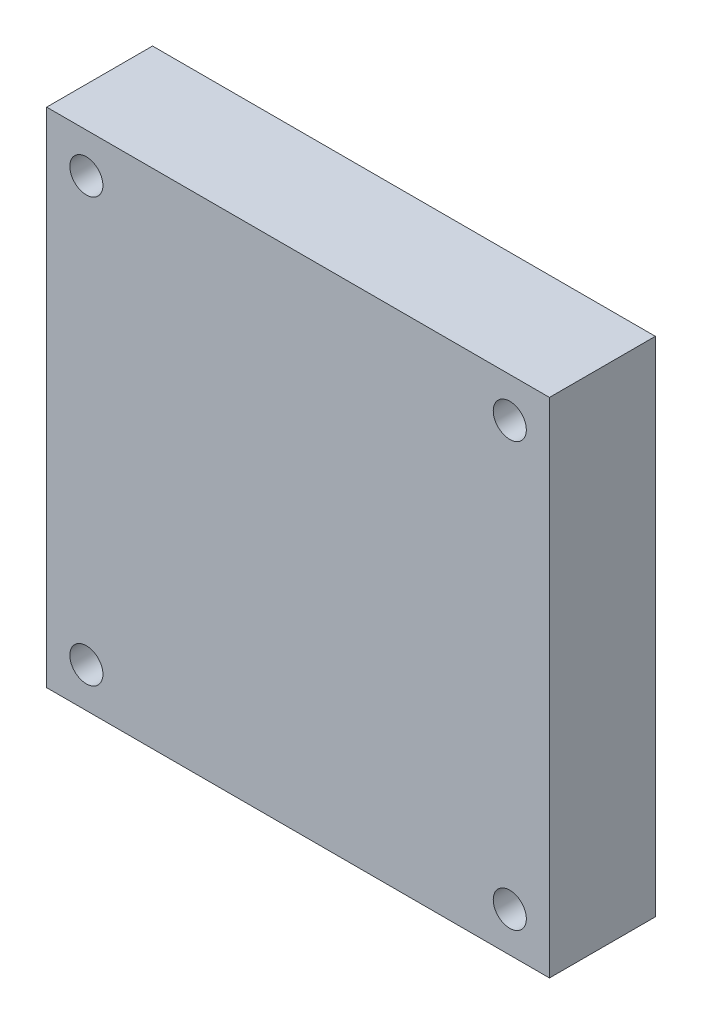
ISO-10303-21;
HEADER;
FILE_DESCRIPTION(('STEP AP214'),'2;1');
FILE_NAME('part.step','',(''),(''),'','','');
FILE_SCHEMA(('AUTOMOTIVE_DESIGN { 1 0 10303 214 1 1 1 1 }'));
ENDSEC;
DATA;
#1=APPLICATION_CONTEXT('core data for automotive mechanical design processes');
#2=APPLICATION_PROTOCOL_DEFINITION('international standard','automotive_design',2000,#1);
#3=PRODUCT_CONTEXT('',#1,'mechanical');
#4=PRODUCT('Part','Part','',(#3));
#5=PRODUCT_RELATED_PRODUCT_CATEGORY('part','',(#4));
#6=PRODUCT_DEFINITION_FORMATION('','',#4);
#7=PRODUCT_DEFINITION_CONTEXT('part definition',#1,'design');
#8=PRODUCT_DEFINITION('design','',#6,#7);
#9=PRODUCT_DEFINITION_SHAPE('','',#8);
#10=(LENGTH_UNIT() NAMED_UNIT(*) SI_UNIT(.MILLI.,.METRE.));
#11=(NAMED_UNIT(*) PLANE_ANGLE_UNIT() SI_UNIT($,.RADIAN.));
#12=(NAMED_UNIT(*) SI_UNIT($,.STERADIAN.) SOLID_ANGLE_UNIT());
#13=UNCERTAINTY_MEASURE_WITH_UNIT(LENGTH_MEASURE(1.E-05),#10,'distance_accuracy_value','');
#14=(GEOMETRIC_REPRESENTATION_CONTEXT(3) GLOBAL_UNCERTAINTY_ASSIGNED_CONTEXT((#13)) GLOBAL_UNIT_ASSIGNED_CONTEXT((#10,
#11,#12)) REPRESENTATION_CONTEXT('',''));
#15=CARTESIAN_POINT('',(0.,0.,0.));
#16=DIRECTION('',(0.,0.,1.));
#17=DIRECTION('',(1.,0.,0.));
#18=AXIS2_PLACEMENT_3D('',#15,#16,#17);
#19=CARTESIAN_POINT('',(0.,0.,4.));
#20=DIRECTION('',(0.,0.,-1.));
#21=DIRECTION('',(-1.,0.,0.));
#22=AXIS2_PLACEMENT_3D('',#19,#20,#21);
#23=PLANE('',#22);
#24=CARTESIAN_POINT('',(-16.,-16.,4.));
#25=DIRECTION('',(0.,0.,-1.));
#26=DIRECTION('',(1.,0.,0.));
#27=AXIS2_PLACEMENT_3D('',#24,#25,#26);
#28=CIRCLE('',#27,1.25);
#29=CARTESIAN_POINT('',(-14.75,-16.,4.));
#30=VERTEX_POINT('',#29);
#31=EDGE_CURVE('E120',#30,#30,#28,.T.);
#32=ORIENTED_EDGE('',*,*,#31,.T.);
#33=EDGE_LOOP('',(#32));
#34=FACE_BOUND('',#33,.T.);
#35=CARTESIAN_POINT('',(-16.,16.,4.));
#36=DIRECTION('',(0.,0.,1.));
#37=DIRECTION('',(1.,0.,0.));
#38=AXIS2_PLACEMENT_3D('',#35,#36,#37);
#39=CIRCLE('',#38,1.25);
#40=CARTESIAN_POINT('',(-14.75,16.,4.));
#41=VERTEX_POINT('',#40);
#42=EDGE_CURVE('E114',#41,#41,#39,.T.);
#43=ORIENTED_EDGE('',*,*,#42,.F.);
#44=EDGE_LOOP('',(#43));
#45=FACE_BOUND('',#44,.T.);
#46=DIRECTION('',(0.,1.,0.));
#47=VECTOR('',#46,1.);
#48=CARTESIAN_POINT('',(19.,-19.,4.));
#49=LINE('',#48,#47);
#50=CARTESIAN_POINT('',(19.,-19.,4.));
#51=VERTEX_POINT('',#50);
#52=CARTESIAN_POINT('',(19.,19.,4.));
#53=VERTEX_POINT('',#52);
#54=EDGE_CURVE('E87',#51,#53,#49,.T.);
#55=ORIENTED_EDGE('',*,*,#54,.T.);
#56=DIRECTION('',(-1.,0.,0.));
#57=VECTOR('',#56,1.);
#58=CARTESIAN_POINT('',(-19.,19.,4.));
#59=LINE('',#58,#57);
#60=CARTESIAN_POINT('',(-19.,19.,4.));
#61=VERTEX_POINT('',#60);
#62=EDGE_CURVE('E82',#53,#61,#59,.T.);
#63=ORIENTED_EDGE('',*,*,#62,.T.);
#64=DIRECTION('',(0.,-1.,0.));
#65=VECTOR('',#64,1.);
#66=CARTESIAN_POINT('',(-19.,-19.,4.));
#67=LINE('',#66,#65);
#68=CARTESIAN_POINT('',(-19.,-19.,4.));
#69=VERTEX_POINT('',#68);
#70=EDGE_CURVE('E85',#61,#69,#67,.T.);
#71=ORIENTED_EDGE('',*,*,#70,.T.);
#72=DIRECTION('',(1.,0.,0.));
#73=VECTOR('',#72,1.);
#74=CARTESIAN_POINT('',(-19.,-19.,4.));
#75=LINE('',#74,#73);
#76=EDGE_CURVE('E52',#69,#51,#75,.T.);
#77=ORIENTED_EDGE('',*,*,#76,.T.);
#78=EDGE_LOOP('',(#55,#63,#71,#77));
#79=FACE_BOUND('',#78,.T.);
#80=CARTESIAN_POINT('',(16.,-16.,4.));
#81=DIRECTION('',(0.,0.,1.));
#82=DIRECTION('',(-1.,0.,0.));
#83=AXIS2_PLACEMENT_3D('',#80,#81,#82);
#84=CIRCLE('',#83,1.25);
#85=CARTESIAN_POINT('',(14.75,-16.,4.));
#86=VERTEX_POINT('',#85);
#87=EDGE_CURVE('E126',#86,#86,#84,.T.);
#88=ORIENTED_EDGE('',*,*,#87,.F.);
#89=EDGE_LOOP('',(#88));
#90=FACE_BOUND('',#89,.T.);
#91=CARTESIAN_POINT('',(16.,16.,4.));
#92=DIRECTION('',(0.,0.,-1.));
#93=DIRECTION('',(-1.,0.,0.));
#94=AXIS2_PLACEMENT_3D('',#91,#92,#93);
#95=CIRCLE('',#94,1.25);
#96=CARTESIAN_POINT('',(14.75,16.,4.));
#97=VERTEX_POINT('',#96);
#98=EDGE_CURVE('E132',#97,#97,#95,.T.);
#99=ORIENTED_EDGE('',*,*,#98,.T.);
#100=EDGE_LOOP('',(#99));
#101=FACE_BOUND('',#100,.T.);
#102=ADVANCED_FACE('F35',(#34,#45,#79,#90,#101),#23,.F.);
#103=CARTESIAN_POINT('',(0.,0.,-4.));
#104=DIRECTION('',(0.,0.,-1.));
#105=DIRECTION('',(-1.,0.,0.));
#106=AXIS2_PLACEMENT_3D('',#103,#104,#105);
#107=PLANE('',#106);
#108=CARTESIAN_POINT('',(-16.,-16.,-4.));
#109=DIRECTION('',(0.,0.,-1.));
#110=DIRECTION('',(1.,0.,0.));
#111=AXIS2_PLACEMENT_3D('',#108,#109,#110);
#112=CIRCLE('',#111,1.25);
#113=CARTESIAN_POINT('',(-14.75,-16.,-4.));
#114=VERTEX_POINT('',#113);
#115=EDGE_CURVE('E117',#114,#114,#112,.T.);
#116=ORIENTED_EDGE('',*,*,#115,.F.);
#117=EDGE_LOOP('',(#116));
#118=FACE_BOUND('',#117,.T.);
#119=CARTESIAN_POINT('',(-16.,16.,-4.));
#120=DIRECTION('',(0.,0.,1.));
#121=DIRECTION('',(1.,0.,0.));
#122=AXIS2_PLACEMENT_3D('',#119,#120,#121);
#123=CIRCLE('',#122,1.25);
#124=CARTESIAN_POINT('',(-14.75,16.,-4.));
#125=VERTEX_POINT('',#124);
#126=EDGE_CURVE('E102',#125,#125,#123,.T.);
#127=ORIENTED_EDGE('',*,*,#126,.T.);
#128=EDGE_LOOP('',(#127));
#129=FACE_BOUND('',#128,.T.);
#130=DIRECTION('',(0.,1.,0.));
#131=VECTOR('',#130,1.);
#132=CARTESIAN_POINT('',(19.,-19.,-4.));
#133=LINE('',#132,#131);
#134=CARTESIAN_POINT('',(19.,-19.,-4.));
#135=VERTEX_POINT('',#134);
#136=CARTESIAN_POINT('',(19.,19.,-4.));
#137=VERTEX_POINT('',#136);
#138=EDGE_CURVE('E99',#135,#137,#133,.T.);
#139=ORIENTED_EDGE('',*,*,#138,.F.);
#140=DIRECTION('',(1.,0.,0.));
#141=VECTOR('',#140,1.);
#142=CARTESIAN_POINT('',(-19.,-19.,-4.));
#143=LINE('',#142,#141);
#144=CARTESIAN_POINT('',(-19.,-19.,-4.));
#145=VERTEX_POINT('',#144);
#146=EDGE_CURVE('E75',#145,#135,#143,.T.);
#147=ORIENTED_EDGE('',*,*,#146,.F.);
#148=DIRECTION('',(0.,-1.,0.));
#149=VECTOR('',#148,1.);
#150=CARTESIAN_POINT('',(-19.,-19.,-4.));
#151=LINE('',#150,#149);
#152=CARTESIAN_POINT('',(-19.,19.,-4.));
#153=VERTEX_POINT('',#152);
#154=EDGE_CURVE('E69',#153,#145,#151,.T.);
#155=ORIENTED_EDGE('',*,*,#154,.F.);
#156=DIRECTION('',(-1.,0.,0.));
#157=VECTOR('',#156,1.);
#158=CARTESIAN_POINT('',(-19.,19.,-4.));
#159=LINE('',#158,#157);
#160=EDGE_CURVE('E91',#137,#153,#159,.T.);
#161=ORIENTED_EDGE('',*,*,#160,.F.);
#162=EDGE_LOOP('',(#139,#147,#155,#161));
#163=FACE_BOUND('',#162,.T.);
#164=CARTESIAN_POINT('',(16.,-16.,-4.));
#165=DIRECTION('',(0.,0.,1.));
#166=DIRECTION('',(-1.,0.,0.));
#167=AXIS2_PLACEMENT_3D('',#164,#165,#166);
#168=CIRCLE('',#167,1.25);
#169=CARTESIAN_POINT('',(14.75,-16.,-4.));
#170=VERTEX_POINT('',#169);
#171=EDGE_CURVE('E123',#170,#170,#168,.T.);
#172=ORIENTED_EDGE('',*,*,#171,.T.);
#173=EDGE_LOOP('',(#172));
#174=FACE_BOUND('',#173,.T.);
#175=CARTESIAN_POINT('',(16.,16.,-4.));
#176=DIRECTION('',(0.,0.,-1.));
#177=DIRECTION('',(-1.,0.,0.));
#178=AXIS2_PLACEMENT_3D('',#175,#176,#177);
#179=CIRCLE('',#178,1.25);
#180=CARTESIAN_POINT('',(14.75,16.,-4.));
#181=VERTEX_POINT('',#180);
#182=EDGE_CURVE('E129',#181,#181,#179,.T.);
#183=ORIENTED_EDGE('',*,*,#182,.F.);
#184=EDGE_LOOP('',(#183));
#185=FACE_BOUND('',#184,.T.);
#186=ADVANCED_FACE('F110',(#118,#129,#163,#174,#185),#107,.T.);
#187=CARTESIAN_POINT('',(19.,-19.,4.));
#188=DIRECTION('',(-1.,0.,0.));
#189=DIRECTION('',(0.,0.,1.));
#190=AXIS2_PLACEMENT_3D('',#187,#188,#189);
#191=PLANE('',#190);
#192=ORIENTED_EDGE('',*,*,#138,.T.);
#193=DIRECTION('',(0.,0.,-1.));
#194=VECTOR('',#193,1.);
#195=CARTESIAN_POINT('',(19.,19.,4.));
#196=LINE('',#195,#194);
#197=EDGE_CURVE('E11',#53,#137,#196,.T.);
#198=ORIENTED_EDGE('',*,*,#197,.F.);
#199=ORIENTED_EDGE('',*,*,#54,.F.);
#200=DIRECTION('',(0.,0.,-1.));
#201=VECTOR('',#200,1.);
#202=CARTESIAN_POINT('',(19.,-19.,4.));
#203=LINE('',#202,#201);
#204=EDGE_CURVE('E95',#51,#135,#203,.T.);
#205=ORIENTED_EDGE('',*,*,#204,.T.);
#206=EDGE_LOOP('',(#192,#198,#199,#205));
#207=FACE_BOUND('',#206,.T.);
#208=ADVANCED_FACE('F37',(#207),#191,.F.);
#209=CARTESIAN_POINT('',(-19.,19.,4.));
#210=DIRECTION('',(0.,-1.,0.));
#211=DIRECTION('',(0.,0.,-1.));
#212=AXIS2_PLACEMENT_3D('',#209,#210,#211);
#213=PLANE('',#212);
#214=ORIENTED_EDGE('',*,*,#160,.T.);
#215=DIRECTION('',(0.,0.,-1.));
#216=VECTOR('',#215,1.);
#217=CARTESIAN_POINT('',(-19.,19.,4.));
#218=LINE('',#217,#216);
#219=EDGE_CURVE('E44',#61,#153,#218,.T.);
#220=ORIENTED_EDGE('',*,*,#219,.F.);
#221=ORIENTED_EDGE('',*,*,#62,.F.);
#222=ORIENTED_EDGE('',*,*,#197,.T.);
#223=EDGE_LOOP('',(#214,#220,#221,#222));
#224=FACE_BOUND('',#223,.T.);
#225=ADVANCED_FACE('F90',(#224),#213,.F.);
#226=CARTESIAN_POINT('',(-19.,-19.,4.));
#227=DIRECTION('',(1.,0.,0.));
#228=DIRECTION('',(0.,0.,-1.));
#229=AXIS2_PLACEMENT_3D('',#226,#227,#228);
#230=PLANE('',#229);
#231=ORIENTED_EDGE('',*,*,#154,.T.);
#232=DIRECTION('',(0.,0.,-1.));
#233=VECTOR('',#232,1.);
#234=CARTESIAN_POINT('',(-19.,-19.,4.));
#235=LINE('',#234,#233);
#236=EDGE_CURVE('E92',#69,#145,#235,.T.);
#237=ORIENTED_EDGE('',*,*,#236,.F.);
#238=ORIENTED_EDGE('',*,*,#70,.F.);
#239=ORIENTED_EDGE('',*,*,#219,.T.);
#240=EDGE_LOOP('',(#231,#237,#238,#239));
#241=FACE_BOUND('',#240,.T.);
#242=ADVANCED_FACE('F93',(#241),#230,.F.);
#243=CARTESIAN_POINT('',(-19.,-19.,4.));
#244=DIRECTION('',(0.,1.,0.));
#245=DIRECTION('',(0.,0.,1.));
#246=AXIS2_PLACEMENT_3D('',#243,#244,#245);
#247=PLANE('',#246);
#248=ORIENTED_EDGE('',*,*,#146,.T.);
#249=ORIENTED_EDGE('',*,*,#204,.F.);
#250=ORIENTED_EDGE('',*,*,#76,.F.);
#251=ORIENTED_EDGE('',*,*,#236,.T.);
#252=EDGE_LOOP('',(#248,#249,#250,#251));
#253=FACE_BOUND('',#252,.T.);
#254=ADVANCED_FACE('F107',(#253),#247,.F.);
#255=CARTESIAN_POINT('',(-16.,16.,-4.));
#256=DIRECTION('',(0.,0.,1.));
#257=DIRECTION('',(1.,0.,0.));
#258=AXIS2_PLACEMENT_3D('',#255,#256,#257);
#259=CYLINDRICAL_SURFACE('',#258,1.25);
#260=ORIENTED_EDGE('',*,*,#126,.F.);
#261=EDGE_LOOP('',(#260));
#262=FACE_BOUND('',#261,.T.);
#263=ORIENTED_EDGE('',*,*,#42,.T.);
#264=EDGE_LOOP('',(#263));
#265=FACE_BOUND('',#264,.T.);
#266=ADVANCED_FACE('F156',(#262,#265),#259,.F.);
#267=CARTESIAN_POINT('',(-16.,-16.,-4.));
#268=DIRECTION('',(0.,0.,1.));
#269=DIRECTION('',(1.,0.,0.));
#270=AXIS2_PLACEMENT_3D('',#267,#268,#269);
#271=CYLINDRICAL_SURFACE('',#270,1.25);
#272=ORIENTED_EDGE('',*,*,#115,.T.);
#273=EDGE_LOOP('',(#272));
#274=FACE_BOUND('',#273,.T.);
#275=ORIENTED_EDGE('',*,*,#31,.F.);
#276=EDGE_LOOP('',(#275));
#277=FACE_BOUND('',#276,.T.);
#278=ADVANCED_FACE('F177',(#274,#277),#271,.F.);
#279=CARTESIAN_POINT('',(16.,-16.,-4.));
#280=DIRECTION('',(0.,0.,1.));
#281=DIRECTION('',(1.,0.,0.));
#282=AXIS2_PLACEMENT_3D('',#279,#280,#281);
#283=CYLINDRICAL_SURFACE('',#282,1.25);
#284=ORIENTED_EDGE('',*,*,#171,.F.);
#285=EDGE_LOOP('',(#284));
#286=FACE_BOUND('',#285,.T.);
#287=ORIENTED_EDGE('',*,*,#87,.T.);
#288=EDGE_LOOP('',(#287));
#289=FACE_BOUND('',#288,.T.);
#290=ADVANCED_FACE('F184',(#286,#289),#283,.F.);
#291=CARTESIAN_POINT('',(16.,16.,-4.));
#292=DIRECTION('',(0.,0.,1.));
#293=DIRECTION('',(1.,0.,0.));
#294=AXIS2_PLACEMENT_3D('',#291,#292,#293);
#295=CYLINDRICAL_SURFACE('',#294,1.25);
#296=ORIENTED_EDGE('',*,*,#182,.T.);
#297=EDGE_LOOP('',(#296));
#298=FACE_BOUND('',#297,.T.);
#299=ORIENTED_EDGE('',*,*,#98,.F.);
#300=EDGE_LOOP('',(#299));
#301=FACE_BOUND('',#300,.T.);
#302=ADVANCED_FACE('F138',(#298,#301),#295,.F.);
#303=CLOSED_SHELL('',(#102,#186,#208,#225,#242,#254,#266,#278,#290,#302));
#304=MANIFOLD_SOLID_BREP('B2',#303);
#305=ADVANCED_BREP_SHAPE_REPRESENTATION('',(#18,#304),#14);
#306=SHAPE_DEFINITION_REPRESENTATION(#9,#305);
ENDSEC;
END-ISO-10303-21;
